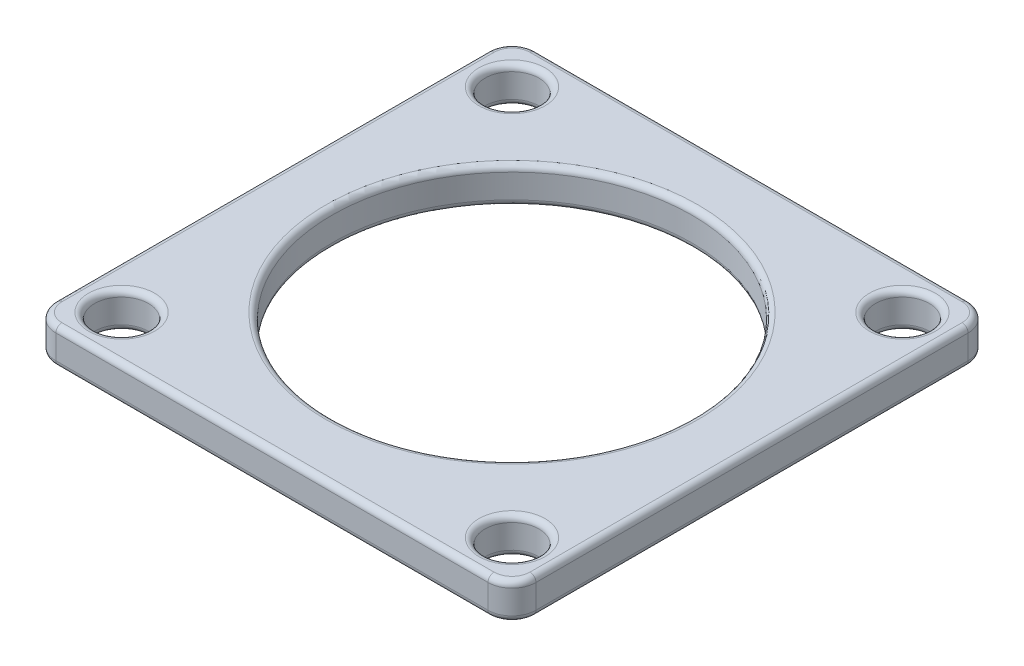
ISO-10303-21;
HEADER;
FILE_DESCRIPTION(('STEP AP214'),'2;1');
FILE_NAME('part.step','',(''),(''),'','','');
FILE_SCHEMA(('AUTOMOTIVE_DESIGN { 1 0 10303 214 1 1 1 1 }'));
ENDSEC;
DATA;
#1=APPLICATION_CONTEXT('core data for automotive mechanical design processes');
#2=APPLICATION_PROTOCOL_DEFINITION('international standard','automotive_design',2000,#1);
#3=PRODUCT_CONTEXT('',#1,'mechanical');
#4=PRODUCT('Part','Part','',(#3));
#5=PRODUCT_RELATED_PRODUCT_CATEGORY('part','',(#4));
#6=PRODUCT_DEFINITION_FORMATION('','',#4);
#7=PRODUCT_DEFINITION_CONTEXT('part definition',#1,'design');
#8=PRODUCT_DEFINITION('design','',#6,#7);
#9=PRODUCT_DEFINITION_SHAPE('','',#8);
#10=(LENGTH_UNIT() NAMED_UNIT(*) SI_UNIT(.MILLI.,.METRE.));
#11=(NAMED_UNIT(*) PLANE_ANGLE_UNIT() SI_UNIT($,.RADIAN.));
#12=(NAMED_UNIT(*) SI_UNIT($,.STERADIAN.) SOLID_ANGLE_UNIT());
#13=UNCERTAINTY_MEASURE_WITH_UNIT(LENGTH_MEASURE(1.E-05),#10,'distance_accuracy_value','');
#14=(GEOMETRIC_REPRESENTATION_CONTEXT(3) GLOBAL_UNCERTAINTY_ASSIGNED_CONTEXT((#13)) GLOBAL_UNIT_ASSIGNED_CONTEXT((#10,
#11,#12)) REPRESENTATION_CONTEXT('',''));
#15=CARTESIAN_POINT('',(0.,0.,0.));
#16=DIRECTION('',(0.,0.,1.));
#17=DIRECTION('',(1.,0.,0.));
#18=AXIS2_PLACEMENT_3D('',#15,#16,#17);
#19=CARTESIAN_POINT('',(18.,3.,18.));
#20=DIRECTION('',(0.,-1.,0.));
#21=DIRECTION('',(0.,0.,-1.));
#22=AXIS2_PLACEMENT_3D('',#19,#20,#21);
#23=PLANE('',#22);
#24=CARTESIAN_POINT('',(0.,3.,0.));
#25=DIRECTION('',(0.,-1.,0.));
#26=DIRECTION('',(0.,0.,-1.));
#27=AXIS2_PLACEMENT_3D('',#24,#25,#26);
#28=CIRCLE('',#27,15.5);
#29=CARTESIAN_POINT('',(0.,3.,-15.5));
#30=VERTEX_POINT('',#29);
#31=EDGE_CURVE('E11',#30,#30,#28,.T.);
#32=ORIENTED_EDGE('',*,*,#31,.T.);
#33=EDGE_LOOP('',(#32));
#34=FACE_BOUND('',#33,.T.);
#35=CARTESIAN_POINT('',(-16.2634559672906,3.,16.2634559672906));
#36=DIRECTION('',(0.,-1.,0.));
#37=DIRECTION('',(0.,0.,-1.));
#38=AXIS2_PLACEMENT_3D('',#35,#36,#37);
#39=CIRCLE('',#38,2.75);
#40=CARTESIAN_POINT('',(-16.2634559672906,3.,13.5134559672906));
#41=VERTEX_POINT('',#40);
#42=EDGE_CURVE('E43',#41,#41,#39,.T.);
#43=ORIENTED_EDGE('',*,*,#42,.T.);
#44=EDGE_LOOP('',(#43));
#45=FACE_BOUND('',#44,.T.);
#46=CARTESIAN_POINT('',(16.2634559672906,3.,16.2634559672906));
#47=DIRECTION('',(0.,-1.,0.));
#48=DIRECTION('',(0.,0.,-1.));
#49=AXIS2_PLACEMENT_3D('',#46,#47,#48);
#50=CIRCLE('',#49,2.75);
#51=CARTESIAN_POINT('',(16.2634559672906,3.,13.5134559672906));
#52=VERTEX_POINT('',#51);
#53=EDGE_CURVE('E273',#52,#52,#50,.T.);
#54=ORIENTED_EDGE('',*,*,#53,.T.);
#55=EDGE_LOOP('',(#54));
#56=FACE_BOUND('',#55,.T.);
#57=CARTESIAN_POINT('',(16.2634559672906,3.,-16.2634559672906));
#58=DIRECTION('',(0.,-1.,0.));
#59=DIRECTION('',(0.,0.,-1.));
#60=AXIS2_PLACEMENT_3D('',#57,#58,#59);
#61=CIRCLE('',#60,2.75);
#62=CARTESIAN_POINT('',(16.2634559672906,3.,-19.0134559672906));
#63=VERTEX_POINT('',#62);
#64=EDGE_CURVE('E270',#63,#63,#61,.T.);
#65=ORIENTED_EDGE('',*,*,#64,.T.);
#66=EDGE_LOOP('',(#65));
#67=FACE_BOUND('',#66,.T.);
#68=CARTESIAN_POINT('',(-16.2634559672906,3.,-16.2634559672906));
#69=DIRECTION('',(0.,-1.,0.));
#70=DIRECTION('',(0.,0.,-1.));
#71=AXIS2_PLACEMENT_3D('',#68,#69,#70);
#72=CIRCLE('',#71,2.75);
#73=CARTESIAN_POINT('',(-16.2634559672906,3.,-19.0134559672906));
#74=VERTEX_POINT('',#73);
#75=EDGE_CURVE('E267',#74,#74,#72,.T.);
#76=ORIENTED_EDGE('',*,*,#75,.T.);
#77=EDGE_LOOP('',(#76));
#78=FACE_BOUND('',#77,.T.);
#79=CARTESIAN_POINT('',(-18.,3.,18.));
#80=DIRECTION('',(0.,-1.,0.));
#81=DIRECTION('',(0.,0.,-1.));
#82=AXIS2_PLACEMENT_3D('',#79,#80,#81);
#83=CIRCLE('',#82,1.5);
#84=CARTESIAN_POINT('',(-19.5,3.,18.));
#85=VERTEX_POINT('',#84);
#86=CARTESIAN_POINT('',(-18.,3.,19.5));
#87=VERTEX_POINT('',#86);
#88=EDGE_CURVE('E51',#85,#87,#83,.F.);
#89=ORIENTED_EDGE('',*,*,#88,.T.);
#90=DIRECTION('',(1.,0.,0.));
#91=VECTOR('',#90,1.);
#92=CARTESIAN_POINT('',(18.,3.,19.5));
#93=LINE('',#92,#91);
#94=CARTESIAN_POINT('',(18.,3.,19.5));
#95=VERTEX_POINT('',#94);
#96=EDGE_CURVE('E265',#87,#95,#93,.T.);
#97=ORIENTED_EDGE('',*,*,#96,.T.);
#98=CARTESIAN_POINT('',(18.,3.,18.));
#99=DIRECTION('',(0.,-1.,0.));
#100=DIRECTION('',(0.,0.,-1.));
#101=AXIS2_PLACEMENT_3D('',#98,#99,#100);
#102=CIRCLE('',#101,1.5);
#103=CARTESIAN_POINT('',(19.5,3.,18.));
#104=VERTEX_POINT('',#103);
#105=EDGE_CURVE('E253',#95,#104,#102,.F.);
#106=ORIENTED_EDGE('',*,*,#105,.T.);
#107=DIRECTION('',(0.,0.,-1.));
#108=VECTOR('',#107,1.);
#109=CARTESIAN_POINT('',(19.5,3.,18.));
#110=LINE('',#109,#108);
#111=CARTESIAN_POINT('',(19.5,3.,-18.));
#112=VERTEX_POINT('',#111);
#113=EDGE_CURVE('E255',#104,#112,#110,.T.);
#114=ORIENTED_EDGE('',*,*,#113,.T.);
#115=CARTESIAN_POINT('',(18.,3.,-18.));
#116=DIRECTION('',(0.,-1.,0.));
#117=DIRECTION('',(0.,0.,-1.));
#118=AXIS2_PLACEMENT_3D('',#115,#116,#117);
#119=CIRCLE('',#118,1.5);
#120=CARTESIAN_POINT('',(18.,3.,-19.5));
#121=VERTEX_POINT('',#120);
#122=EDGE_CURVE('E257',#112,#121,#119,.F.);
#123=ORIENTED_EDGE('',*,*,#122,.T.);
#124=DIRECTION('',(-1.,0.,0.));
#125=VECTOR('',#124,1.);
#126=CARTESIAN_POINT('',(18.,3.,-19.5));
#127=LINE('',#126,#125);
#128=CARTESIAN_POINT('',(-18.,3.,-19.5));
#129=VERTEX_POINT('',#128);
#130=EDGE_CURVE('E259',#121,#129,#127,.T.);
#131=ORIENTED_EDGE('',*,*,#130,.T.);
#132=CARTESIAN_POINT('',(-18.,3.,-18.));
#133=DIRECTION('',(0.,-1.,0.));
#134=DIRECTION('',(0.,0.,-1.));
#135=AXIS2_PLACEMENT_3D('',#132,#133,#134);
#136=CIRCLE('',#135,1.5);
#137=CARTESIAN_POINT('',(-19.5,3.,-18.));
#138=VERTEX_POINT('',#137);
#139=EDGE_CURVE('E261',#129,#138,#136,.F.);
#140=ORIENTED_EDGE('',*,*,#139,.T.);
#141=DIRECTION('',(0.,0.,1.));
#142=VECTOR('',#141,1.);
#143=CARTESIAN_POINT('',(-19.5,3.,18.));
#144=LINE('',#143,#142);
#145=EDGE_CURVE('E56',#138,#85,#144,.T.);
#146=ORIENTED_EDGE('',*,*,#145,.T.);
#147=EDGE_LOOP('',(#89,#97,#106,#114,#123,#131,#140,#146));
#148=FACE_BOUND('',#147,.T.);
#149=ADVANCED_FACE('F34',(#34,#45,#56,#67,#78,#148),#23,.F.);
#150=CARTESIAN_POINT('',(18.,0.,18.));
#151=DIRECTION('',(0.,-1.,0.));
#152=DIRECTION('',(0.,0.,-1.));
#153=AXIS2_PLACEMENT_3D('',#150,#151,#152);
#154=PLANE('',#153);
#155=CARTESIAN_POINT('',(0.,0.,0.));
#156=DIRECTION('',(0.,-1.,0.));
#157=DIRECTION('',(0.,0.,-1.));
#158=AXIS2_PLACEMENT_3D('',#155,#156,#157);
#159=CIRCLE('',#158,15.5);
#160=CARTESIAN_POINT('',(0.,0.,-15.5));
#161=VERTEX_POINT('',#160);
#162=EDGE_CURVE('E188',#161,#161,#159,.F.);
#163=ORIENTED_EDGE('',*,*,#162,.T.);
#164=EDGE_LOOP('',(#163));
#165=FACE_BOUND('',#164,.T.);
#166=CARTESIAN_POINT('',(16.2634559672906,0.,16.2634559672906));
#167=DIRECTION('',(0.,-1.,0.));
#168=DIRECTION('',(0.,0.,-1.));
#169=AXIS2_PLACEMENT_3D('',#166,#167,#168);
#170=CIRCLE('',#169,2.75);
#171=CARTESIAN_POINT('',(16.2634559672906,0.,13.5134559672906));
#172=VERTEX_POINT('',#171);
#173=EDGE_CURVE('E180',#172,#172,#170,.F.);
#174=ORIENTED_EDGE('',*,*,#173,.T.);
#175=EDGE_LOOP('',(#174));
#176=FACE_BOUND('',#175,.T.);
#177=CARTESIAN_POINT('',(-16.2634559672906,0.,-16.2634559672906));
#178=DIRECTION('',(0.,-1.,0.));
#179=DIRECTION('',(0.,0.,-1.));
#180=AXIS2_PLACEMENT_3D('',#177,#178,#179);
#181=CIRCLE('',#180,2.75);
#182=CARTESIAN_POINT('',(-16.2634559672906,0.,-19.0134559672906));
#183=VERTEX_POINT('',#182);
#184=EDGE_CURVE('E177',#183,#183,#181,.F.);
#185=ORIENTED_EDGE('',*,*,#184,.T.);
#186=EDGE_LOOP('',(#185));
#187=FACE_BOUND('',#186,.T.);
#188=CARTESIAN_POINT('',(18.,0.,-18.));
#189=DIRECTION('',(0.,-1.,0.));
#190=DIRECTION('',(0.,0.,-1.));
#191=AXIS2_PLACEMENT_3D('',#188,#189,#190);
#192=CIRCLE('',#191,1.5);
#193=CARTESIAN_POINT('',(18.,0.,-19.5));
#194=VERTEX_POINT('',#193);
#195=CARTESIAN_POINT('',(19.5,0.,-18.));
#196=VERTEX_POINT('',#195);
#197=EDGE_CURVE('E176',#194,#196,#192,.T.);
#198=ORIENTED_EDGE('',*,*,#197,.T.);
#199=DIRECTION('',(0.,0.,-1.));
#200=VECTOR('',#199,1.);
#201=CARTESIAN_POINT('',(19.5,0.,18.));
#202=LINE('',#201,#200);
#203=CARTESIAN_POINT('',(19.5,0.,18.));
#204=VERTEX_POINT('',#203);
#205=EDGE_CURVE('E154',#196,#204,#202,.F.);
#206=ORIENTED_EDGE('',*,*,#205,.T.);
#207=CARTESIAN_POINT('',(18.,0.,18.));
#208=DIRECTION('',(0.,-1.,0.));
#209=DIRECTION('',(0.,0.,-1.));
#210=AXIS2_PLACEMENT_3D('',#207,#208,#209);
#211=CIRCLE('',#210,1.5);
#212=CARTESIAN_POINT('',(18.,0.,19.5));
#213=VERTEX_POINT('',#212);
#214=EDGE_CURVE('E164',#204,#213,#211,.T.);
#215=ORIENTED_EDGE('',*,*,#214,.T.);
#216=DIRECTION('',(1.,0.,0.));
#217=VECTOR('',#216,1.);
#218=CARTESIAN_POINT('',(-18.,0.,19.5));
#219=LINE('',#218,#217);
#220=CARTESIAN_POINT('',(-18.,0.,19.5));
#221=VERTEX_POINT('',#220);
#222=EDGE_CURVE('E170',#213,#221,#219,.F.);
#223=ORIENTED_EDGE('',*,*,#222,.T.);
#224=CARTESIAN_POINT('',(-18.,0.,18.));
#225=DIRECTION('',(0.,-1.,0.));
#226=DIRECTION('',(0.,0.,-1.));
#227=AXIS2_PLACEMENT_3D('',#224,#225,#226);
#228=CIRCLE('',#227,1.5);
#229=CARTESIAN_POINT('',(-19.5,0.,18.));
#230=VERTEX_POINT('',#229);
#231=EDGE_CURVE('E356',#221,#230,#228,.T.);
#232=ORIENTED_EDGE('',*,*,#231,.T.);
#233=DIRECTION('',(0.,0.,1.));
#234=VECTOR('',#233,1.);
#235=CARTESIAN_POINT('',(-19.5,0.,-18.));
#236=LINE('',#235,#234);
#237=CARTESIAN_POINT('',(-19.5,0.,-18.));
#238=VERTEX_POINT('',#237);
#239=EDGE_CURVE('E358',#230,#238,#236,.F.);
#240=ORIENTED_EDGE('',*,*,#239,.T.);
#241=CARTESIAN_POINT('',(-18.,0.,-18.));
#242=DIRECTION('',(0.,-1.,0.));
#243=DIRECTION('',(0.,0.,-1.));
#244=AXIS2_PLACEMENT_3D('',#241,#242,#243);
#245=CIRCLE('',#244,1.5);
#246=CARTESIAN_POINT('',(-18.,0.,-19.5));
#247=VERTEX_POINT('',#246);
#248=EDGE_CURVE('E360',#238,#247,#245,.T.);
#249=ORIENTED_EDGE('',*,*,#248,.T.);
#250=DIRECTION('',(-1.,0.,0.));
#251=VECTOR('',#250,1.);
#252=CARTESIAN_POINT('',(18.,0.,-19.5));
#253=LINE('',#252,#251);
#254=EDGE_CURVE('E182',#247,#194,#253,.F.);
#255=ORIENTED_EDGE('',*,*,#254,.T.);
#256=EDGE_LOOP('',(#198,#206,#215,#223,#232,#240,#249,#255));
#257=FACE_BOUND('',#256,.T.);
#258=CARTESIAN_POINT('',(16.2634559672906,0.,-16.2634559672906));
#259=DIRECTION('',(0.,-1.,0.));
#260=DIRECTION('',(0.,0.,-1.));
#261=AXIS2_PLACEMENT_3D('',#258,#259,#260);
#262=CIRCLE('',#261,2.75);
#263=CARTESIAN_POINT('',(16.2634559672906,0.,-19.0134559672906));
#264=VERTEX_POINT('',#263);
#265=EDGE_CURVE('E171',#264,#264,#262,.F.);
#266=ORIENTED_EDGE('',*,*,#265,.T.);
#267=EDGE_LOOP('',(#266));
#268=FACE_BOUND('',#267,.T.);
#269=CARTESIAN_POINT('',(-16.2634559672906,0.,16.2634559672906));
#270=DIRECTION('',(0.,-1.,0.));
#271=DIRECTION('',(0.,0.,-1.));
#272=AXIS2_PLACEMENT_3D('',#269,#270,#271);
#273=CIRCLE('',#272,2.75);
#274=CARTESIAN_POINT('',(-16.2634559672906,0.,13.5134559672906));
#275=VERTEX_POINT('',#274);
#276=EDGE_CURVE('E350',#275,#275,#273,.F.);
#277=ORIENTED_EDGE('',*,*,#276,.T.);
#278=EDGE_LOOP('',(#277));
#279=FACE_BOUND('',#278,.T.);
#280=ADVANCED_FACE('F173',(#165,#176,#187,#257,#268,#279),#154,.T.);
#281=CARTESIAN_POINT('',(18.,3.,18.));
#282=DIRECTION('',(0.,-1.,0.));
#283=DIRECTION('',(0.,0.,-1.));
#284=AXIS2_PLACEMENT_3D('',#281,#282,#283);
#285=CYLINDRICAL_SURFACE('',#284,2.);
#286=DIRECTION('',(0.,-1.,0.));
#287=VECTOR('',#286,1.);
#288=CARTESIAN_POINT('',(18.,3.,20.));
#289=LINE('',#288,#287);
#290=CARTESIAN_POINT('',(18.,2.5,20.));
#291=VERTEX_POINT('',#290);
#292=CARTESIAN_POINT('',(18.,0.5,20.));
#293=VERTEX_POINT('',#292);
#294=EDGE_CURVE('E294',#291,#293,#289,.T.);
#295=ORIENTED_EDGE('',*,*,#294,.T.);
#296=CARTESIAN_POINT('',(18.,0.5,18.));
#297=DIRECTION('',(0.,-1.,0.));
#298=DIRECTION('',(0.,0.,-1.));
#299=AXIS2_PLACEMENT_3D('',#296,#297,#298);
#300=CIRCLE('',#299,2.);
#301=CARTESIAN_POINT('',(20.,0.5,18.));
#302=VERTEX_POINT('',#301);
#303=EDGE_CURVE('E239',#293,#302,#300,.F.);
#304=ORIENTED_EDGE('',*,*,#303,.T.);
#305=DIRECTION('',(0.,-1.,0.));
#306=VECTOR('',#305,1.);
#307=CARTESIAN_POINT('',(20.,3.,18.));
#308=LINE('',#307,#306);
#309=CARTESIAN_POINT('',(20.,2.5,18.));
#310=VERTEX_POINT('',#309);
#311=EDGE_CURVE('E342',#310,#302,#308,.T.);
#312=ORIENTED_EDGE('',*,*,#311,.F.);
#313=CARTESIAN_POINT('',(18.,2.5,18.));
#314=DIRECTION('',(0.,-1.,0.));
#315=DIRECTION('',(0.,0.,-1.));
#316=AXIS2_PLACEMENT_3D('',#313,#314,#315);
#317=CIRCLE('',#316,2.);
#318=EDGE_CURVE('E237',#310,#291,#317,.T.);
#319=ORIENTED_EDGE('',*,*,#318,.T.);
#320=EDGE_LOOP('',(#295,#304,#312,#319));
#321=FACE_BOUND('',#320,.T.);
#322=ADVANCED_FACE('F377',(#321),#285,.T.);
#323=CARTESIAN_POINT('',(20.,3.,-18.));
#324=DIRECTION('',(-1.,0.,0.));
#325=DIRECTION('',(0.,0.,1.));
#326=AXIS2_PLACEMENT_3D('',#323,#324,#325);
#327=PLANE('',#326);
#328=ORIENTED_EDGE('',*,*,#311,.T.);
#329=DIRECTION('',(0.,0.,-1.));
#330=VECTOR('',#329,1.);
#331=CARTESIAN_POINT('',(20.,0.5,-18.));
#332=LINE('',#331,#330);
#333=CARTESIAN_POINT('',(20.,0.5,-18.));
#334=VERTEX_POINT('',#333);
#335=EDGE_CURVE('E157',#302,#334,#332,.T.);
#336=ORIENTED_EDGE('',*,*,#335,.T.);
#337=DIRECTION('',(0.,-1.,0.));
#338=VECTOR('',#337,1.);
#339=CARTESIAN_POINT('',(20.,3.,-18.));
#340=LINE('',#339,#338);
#341=CARTESIAN_POINT('',(20.,2.5,-18.));
#342=VERTEX_POINT('',#341);
#343=EDGE_CURVE('E340',#342,#334,#340,.T.);
#344=ORIENTED_EDGE('',*,*,#343,.F.);
#345=DIRECTION('',(0.,0.,-1.));
#346=VECTOR('',#345,1.);
#347=CARTESIAN_POINT('',(20.,2.5,-18.));
#348=LINE('',#347,#346);
#349=EDGE_CURVE('E209',#342,#310,#348,.F.);
#350=ORIENTED_EDGE('',*,*,#349,.T.);
#351=EDGE_LOOP('',(#328,#336,#344,#350));
#352=FACE_BOUND('',#351,.T.);
#353=ADVANCED_FACE('F370',(#352),#327,.F.);
#354=CARTESIAN_POINT('',(18.,3.,-18.));
#355=DIRECTION('',(0.,-1.,0.));
#356=DIRECTION('',(0.,0.,-1.));
#357=AXIS2_PLACEMENT_3D('',#354,#355,#356);
#358=CYLINDRICAL_SURFACE('',#357,2.);
#359=ORIENTED_EDGE('',*,*,#343,.T.);
#360=CARTESIAN_POINT('',(18.,0.5,-18.));
#361=DIRECTION('',(0.,-1.,0.));
#362=DIRECTION('',(0.,0.,-1.));
#363=AXIS2_PLACEMENT_3D('',#360,#361,#362);
#364=CIRCLE('',#363,2.);
#365=CARTESIAN_POINT('',(18.,0.5,-20.));
#366=VERTEX_POINT('',#365);
#367=EDGE_CURVE('E214',#334,#366,#364,.F.);
#368=ORIENTED_EDGE('',*,*,#367,.T.);
#369=DIRECTION('',(0.,-1.,0.));
#370=VECTOR('',#369,1.);
#371=CARTESIAN_POINT('',(18.,3.,-20.));
#372=LINE('',#371,#370);
#373=CARTESIAN_POINT('',(18.,2.5,-20.));
#374=VERTEX_POINT('',#373);
#375=EDGE_CURVE('E331',#374,#366,#372,.T.);
#376=ORIENTED_EDGE('',*,*,#375,.F.);
#377=CARTESIAN_POINT('',(18.,2.5,-18.));
#378=DIRECTION('',(0.,-1.,0.));
#379=DIRECTION('',(0.,0.,-1.));
#380=AXIS2_PLACEMENT_3D('',#377,#378,#379);
#381=CIRCLE('',#380,2.);
#382=EDGE_CURVE('E212',#374,#342,#381,.T.);
#383=ORIENTED_EDGE('',*,*,#382,.T.);
#384=EDGE_LOOP('',(#359,#368,#376,#383));
#385=FACE_BOUND('',#384,.T.);
#386=ADVANCED_FACE('F337',(#385),#358,.T.);
#387=CARTESIAN_POINT('',(-18.,3.,-20.));
#388=DIRECTION('',(0.,0.,1.));
#389=DIRECTION('',(1.,0.,0.));
#390=AXIS2_PLACEMENT_3D('',#387,#388,#389);
#391=PLANE('',#390);
#392=ORIENTED_EDGE('',*,*,#375,.T.);
#393=DIRECTION('',(-1.,0.,0.));
#394=VECTOR('',#393,1.);
#395=CARTESIAN_POINT('',(-18.,0.5,-20.));
#396=LINE('',#395,#394);
#397=CARTESIAN_POINT('',(-18.,0.5,-20.));
#398=VERTEX_POINT('',#397);
#399=EDGE_CURVE('E218',#366,#398,#396,.T.);
#400=ORIENTED_EDGE('',*,*,#399,.T.);
#401=DIRECTION('',(0.,-1.,0.));
#402=VECTOR('',#401,1.);
#403=CARTESIAN_POINT('',(-18.,3.,-20.));
#404=LINE('',#403,#402);
#405=CARTESIAN_POINT('',(-18.,2.5,-20.));
#406=VERTEX_POINT('',#405);
#407=EDGE_CURVE('E334',#406,#398,#404,.T.);
#408=ORIENTED_EDGE('',*,*,#407,.F.);
#409=DIRECTION('',(-1.,0.,0.));
#410=VECTOR('',#409,1.);
#411=CARTESIAN_POINT('',(-18.,2.5,-20.));
#412=LINE('',#411,#410);
#413=EDGE_CURVE('E216',#406,#374,#412,.F.);
#414=ORIENTED_EDGE('',*,*,#413,.T.);
#415=EDGE_LOOP('',(#392,#400,#408,#414));
#416=FACE_BOUND('',#415,.T.);
#417=ADVANCED_FACE('F330',(#416),#391,.F.);
#418=CARTESIAN_POINT('',(-18.,3.,-18.));
#419=DIRECTION('',(0.,-1.,0.));
#420=DIRECTION('',(0.,0.,-1.));
#421=AXIS2_PLACEMENT_3D('',#418,#419,#420);
#422=CYLINDRICAL_SURFACE('',#421,2.);
#423=ORIENTED_EDGE('',*,*,#407,.T.);
#424=CARTESIAN_POINT('',(-18.,0.5,-18.));
#425=DIRECTION('',(0.,-1.,0.));
#426=DIRECTION('',(0.,0.,-1.));
#427=AXIS2_PLACEMENT_3D('',#424,#425,#426);
#428=CIRCLE('',#427,2.);
#429=CARTESIAN_POINT('',(-20.,0.5,-18.));
#430=VERTEX_POINT('',#429);
#431=EDGE_CURVE('E222',#398,#430,#428,.F.);
#432=ORIENTED_EDGE('',*,*,#431,.T.);
#433=DIRECTION('',(0.,-1.,0.));
#434=VECTOR('',#433,1.);
#435=CARTESIAN_POINT('',(-20.,3.,-18.));
#436=LINE('',#435,#434);
#437=CARTESIAN_POINT('',(-20.,2.5,-18.));
#438=VERTEX_POINT('',#437);
#439=EDGE_CURVE('E344',#438,#430,#436,.T.);
#440=ORIENTED_EDGE('',*,*,#439,.F.);
#441=CARTESIAN_POINT('',(-18.,2.5,-18.));
#442=DIRECTION('',(0.,-1.,0.));
#443=DIRECTION('',(0.,0.,-1.));
#444=AXIS2_PLACEMENT_3D('',#441,#442,#443);
#445=CIRCLE('',#444,2.);
#446=EDGE_CURVE('E220',#438,#406,#445,.T.);
#447=ORIENTED_EDGE('',*,*,#446,.T.);
#448=EDGE_LOOP('',(#423,#432,#440,#447));
#449=FACE_BOUND('',#448,.T.);
#450=ADVANCED_FACE('F422',(#449),#422,.T.);
#451=CARTESIAN_POINT('',(-20.,3.,-18.));
#452=DIRECTION('',(1.,0.,0.));
#453=DIRECTION('',(0.,0.,-1.));
#454=AXIS2_PLACEMENT_3D('',#451,#452,#453);
#455=PLANE('',#454);
#456=ORIENTED_EDGE('',*,*,#439,.T.);
#457=DIRECTION('',(0.,0.,1.));
#458=VECTOR('',#457,1.);
#459=CARTESIAN_POINT('',(-20.,0.5,18.));
#460=LINE('',#459,#458);
#461=CARTESIAN_POINT('',(-20.,0.5,18.));
#462=VERTEX_POINT('',#461);
#463=EDGE_CURVE('E226',#430,#462,#460,.T.);
#464=ORIENTED_EDGE('',*,*,#463,.T.);
#465=DIRECTION('',(0.,-1.,0.));
#466=VECTOR('',#465,1.);
#467=CARTESIAN_POINT('',(-20.,3.,18.));
#468=LINE('',#467,#466);
#469=CARTESIAN_POINT('',(-20.,2.5,18.));
#470=VERTEX_POINT('',#469);
#471=EDGE_CURVE('E403',#470,#462,#468,.T.);
#472=ORIENTED_EDGE('',*,*,#471,.F.);
#473=DIRECTION('',(0.,0.,1.));
#474=VECTOR('',#473,1.);
#475=CARTESIAN_POINT('',(-20.,2.5,-18.));
#476=LINE('',#475,#474);
#477=EDGE_CURVE('E224',#470,#438,#476,.F.);
#478=ORIENTED_EDGE('',*,*,#477,.T.);
#479=EDGE_LOOP('',(#456,#464,#472,#478));
#480=FACE_BOUND('',#479,.T.);
#481=ADVANCED_FACE('F411',(#480),#455,.F.);
#482=CARTESIAN_POINT('',(-18.,3.,18.));
#483=DIRECTION('',(0.,-1.,0.));
#484=DIRECTION('',(0.,0.,-1.));
#485=AXIS2_PLACEMENT_3D('',#482,#483,#484);
#486=CYLINDRICAL_SURFACE('',#485,2.);
#487=ORIENTED_EDGE('',*,*,#471,.T.);
#488=CARTESIAN_POINT('',(-18.,0.5,18.));
#489=DIRECTION('',(0.,-1.,0.));
#490=DIRECTION('',(0.,0.,-1.));
#491=AXIS2_PLACEMENT_3D('',#488,#489,#490);
#492=CIRCLE('',#491,2.);
#493=CARTESIAN_POINT('',(-18.,0.5,20.));
#494=VERTEX_POINT('',#493);
#495=EDGE_CURVE('E230',#462,#494,#492,.F.);
#496=ORIENTED_EDGE('',*,*,#495,.T.);
#497=DIRECTION('',(0.,-1.,0.));
#498=VECTOR('',#497,1.);
#499=CARTESIAN_POINT('',(-18.,3.,20.));
#500=LINE('',#499,#498);
#501=CARTESIAN_POINT('',(-18.,2.5,20.));
#502=VERTEX_POINT('',#501);
#503=EDGE_CURVE('E396',#502,#494,#500,.T.);
#504=ORIENTED_EDGE('',*,*,#503,.F.);
#505=CARTESIAN_POINT('',(-18.,2.5,18.));
#506=DIRECTION('',(0.,-1.,0.));
#507=DIRECTION('',(0.,0.,-1.));
#508=AXIS2_PLACEMENT_3D('',#505,#506,#507);
#509=CIRCLE('',#508,2.);
#510=EDGE_CURVE('E228',#502,#470,#509,.T.);
#511=ORIENTED_EDGE('',*,*,#510,.T.);
#512=EDGE_LOOP('',(#487,#496,#504,#511));
#513=FACE_BOUND('',#512,.T.);
#514=ADVANCED_FACE('F400',(#513),#486,.T.);
#515=CARTESIAN_POINT('',(-18.,3.,20.));
#516=DIRECTION('',(0.,0.,-1.));
#517=DIRECTION('',(-1.,0.,0.));
#518=AXIS2_PLACEMENT_3D('',#515,#516,#517);
#519=PLANE('',#518);
#520=ORIENTED_EDGE('',*,*,#503,.T.);
#521=DIRECTION('',(1.,0.,0.));
#522=VECTOR('',#521,1.);
#523=CARTESIAN_POINT('',(18.,0.5,20.));
#524=LINE('',#523,#522);
#525=EDGE_CURVE('E235',#494,#293,#524,.T.);
#526=ORIENTED_EDGE('',*,*,#525,.T.);
#527=ORIENTED_EDGE('',*,*,#294,.F.);
#528=DIRECTION('',(1.,0.,0.));
#529=VECTOR('',#528,1.);
#530=CARTESIAN_POINT('',(-18.,2.5,20.));
#531=LINE('',#530,#529);
#532=EDGE_CURVE('E232',#291,#502,#531,.F.);
#533=ORIENTED_EDGE('',*,*,#532,.T.);
#534=EDGE_LOOP('',(#520,#526,#527,#533));
#535=FACE_BOUND('',#534,.T.);
#536=ADVANCED_FACE('F395',(#535),#519,.F.);
#537=CARTESIAN_POINT('',(-16.2634559672906,3.,-16.2634559672906));
#538=DIRECTION('',(0.,-1.,0.));
#539=DIRECTION('',(0.,0.,-1.));
#540=AXIS2_PLACEMENT_3D('',#537,#538,#539);
#541=CYLINDRICAL_SURFACE('',#540,2.25);
#542=CARTESIAN_POINT('',(-16.2634559672906,0.5,-16.2634559672906));
#543=DIRECTION('',(0.,-1.,0.));
#544=DIRECTION('',(0.,0.,-1.));
#545=AXIS2_PLACEMENT_3D('',#542,#543,#544);
#546=CIRCLE('',#545,2.25);
#547=CARTESIAN_POINT('',(-16.2634559672906,0.5,-18.5134559672906));
#548=VERTEX_POINT('',#547);
#549=EDGE_CURVE('E206',#548,#548,#546,.T.);
#550=ORIENTED_EDGE('',*,*,#549,.T.);
#551=EDGE_LOOP('',(#550));
#552=FACE_BOUND('',#551,.T.);
#553=CARTESIAN_POINT('',(-16.2634559672906,2.5,-16.2634559672906));
#554=DIRECTION('',(0.,-1.,0.));
#555=DIRECTION('',(0.,0.,-1.));
#556=AXIS2_PLACEMENT_3D('',#553,#554,#555);
#557=CIRCLE('',#556,2.25);
#558=CARTESIAN_POINT('',(-16.2634559672906,2.5,-18.5134559672906));
#559=VERTEX_POINT('',#558);
#560=EDGE_CURVE('E203',#559,#559,#557,.F.);
#561=ORIENTED_EDGE('',*,*,#560,.T.);
#562=EDGE_LOOP('',(#561));
#563=FACE_BOUND('',#562,.T.);
#564=ADVANCED_FACE('F441',(#552,#563),#541,.F.);
#565=CARTESIAN_POINT('',(16.2634559672906,3.,-16.2634559672906));
#566=DIRECTION('',(0.,-1.,0.));
#567=DIRECTION('',(0.,0.,-1.));
#568=AXIS2_PLACEMENT_3D('',#565,#566,#567);
#569=CYLINDRICAL_SURFACE('',#568,2.25);
#570=CARTESIAN_POINT('',(16.2634559672906,0.5,-16.2634559672906));
#571=DIRECTION('',(0.,-1.,0.));
#572=DIRECTION('',(0.,0.,-1.));
#573=AXIS2_PLACEMENT_3D('',#570,#571,#572);
#574=CIRCLE('',#573,2.25);
#575=CARTESIAN_POINT('',(16.2634559672906,0.5,-18.5134559672906));
#576=VERTEX_POINT('',#575);
#577=EDGE_CURVE('E244',#576,#576,#574,.T.);
#578=ORIENTED_EDGE('',*,*,#577,.T.);
#579=EDGE_LOOP('',(#578));
#580=FACE_BOUND('',#579,.T.);
#581=CARTESIAN_POINT('',(16.2634559672906,2.5,-16.2634559672906));
#582=DIRECTION('',(0.,-1.,0.));
#583=DIRECTION('',(0.,0.,-1.));
#584=AXIS2_PLACEMENT_3D('',#581,#582,#583);
#585=CIRCLE('',#584,2.25);
#586=CARTESIAN_POINT('',(16.2634559672906,2.5,-18.5134559672906));
#587=VERTEX_POINT('',#586);
#588=EDGE_CURVE('E241',#587,#587,#585,.F.);
#589=ORIENTED_EDGE('',*,*,#588,.T.);
#590=EDGE_LOOP('',(#589));
#591=FACE_BOUND('',#590,.T.);
#592=ADVANCED_FACE('F461',(#580,#591),#569,.F.);
#593=CARTESIAN_POINT('',(16.2634559672906,3.,16.2634559672906));
#594=DIRECTION('',(0.,-1.,0.));
#595=DIRECTION('',(0.,0.,-1.));
#596=AXIS2_PLACEMENT_3D('',#593,#594,#595);
#597=CYLINDRICAL_SURFACE('',#596,2.25);
#598=CARTESIAN_POINT('',(16.2634559672906,0.5,16.2634559672906));
#599=DIRECTION('',(0.,-1.,0.));
#600=DIRECTION('',(0.,0.,-1.));
#601=AXIS2_PLACEMENT_3D('',#598,#599,#600);
#602=CIRCLE('',#601,2.25);
#603=CARTESIAN_POINT('',(16.2634559672906,0.5,14.0134559672906));
#604=VERTEX_POINT('',#603);
#605=EDGE_CURVE('E200',#604,#604,#602,.T.);
#606=ORIENTED_EDGE('',*,*,#605,.T.);
#607=EDGE_LOOP('',(#606));
#608=FACE_BOUND('',#607,.T.);
#609=CARTESIAN_POINT('',(16.2634559672906,2.5,16.2634559672906));
#610=DIRECTION('',(0.,-1.,0.));
#611=DIRECTION('',(0.,0.,-1.));
#612=AXIS2_PLACEMENT_3D('',#609,#610,#611);
#613=CIRCLE('',#612,2.25);
#614=CARTESIAN_POINT('',(16.2634559672906,2.5,14.0134559672906));
#615=VERTEX_POINT('',#614);
#616=EDGE_CURVE('E197',#615,#615,#613,.F.);
#617=ORIENTED_EDGE('',*,*,#616,.T.);
#618=EDGE_LOOP('',(#617));
#619=FACE_BOUND('',#618,.T.);
#620=ADVANCED_FACE('F468',(#608,#619),#597,.F.);
#621=CARTESIAN_POINT('',(-16.2634559672906,3.,16.2634559672906));
#622=DIRECTION('',(0.,-1.,0.));
#623=DIRECTION('',(0.,0.,-1.));
#624=AXIS2_PLACEMENT_3D('',#621,#622,#623);
#625=CYLINDRICAL_SURFACE('',#624,2.25);
#626=CARTESIAN_POINT('',(-16.2634559672906,0.5,16.2634559672906));
#627=DIRECTION('',(0.,-1.,0.));
#628=DIRECTION('',(0.,0.,-1.));
#629=AXIS2_PLACEMENT_3D('',#626,#627,#628);
#630=CIRCLE('',#629,2.25);
#631=CARTESIAN_POINT('',(-16.2634559672906,0.5,14.0134559672906));
#632=VERTEX_POINT('',#631);
#633=EDGE_CURVE('E250',#632,#632,#630,.T.);
#634=ORIENTED_EDGE('',*,*,#633,.T.);
#635=EDGE_LOOP('',(#634));
#636=FACE_BOUND('',#635,.T.);
#637=CARTESIAN_POINT('',(-16.2634559672906,2.5,16.2634559672906));
#638=DIRECTION('',(0.,-1.,0.));
#639=DIRECTION('',(0.,0.,-1.));
#640=AXIS2_PLACEMENT_3D('',#637,#638,#639);
#641=CIRCLE('',#640,2.25);
#642=CARTESIAN_POINT('',(-16.2634559672906,2.5,14.0134559672906));
#643=VERTEX_POINT('',#642);
#644=EDGE_CURVE('E247',#643,#643,#641,.F.);
#645=ORIENTED_EDGE('',*,*,#644,.T.);
#646=EDGE_LOOP('',(#645));
#647=FACE_BOUND('',#646,.T.);
#648=ADVANCED_FACE('F475',(#636,#647),#625,.F.);
#649=CARTESIAN_POINT('',(0.,3.,0.));
#650=DIRECTION('',(0.,-1.,0.));
#651=DIRECTION('',(0.,0.,-1.));
#652=AXIS2_PLACEMENT_3D('',#649,#650,#651);
#653=CYLINDRICAL_SURFACE('',#652,15.);
#654=CARTESIAN_POINT('',(0.,0.5,0.));
#655=DIRECTION('',(0.,-1.,0.));
#656=DIRECTION('',(0.,0.,-1.));
#657=AXIS2_PLACEMENT_3D('',#654,#655,#656);
#658=CIRCLE('',#657,15.);
#659=CARTESIAN_POINT('',(0.,0.5,-15.));
#660=VERTEX_POINT('',#659);
#661=EDGE_CURVE('E194',#660,#660,#658,.T.);
#662=ORIENTED_EDGE('',*,*,#661,.T.);
#663=EDGE_LOOP('',(#662));
#664=FACE_BOUND('',#663,.T.);
#665=CARTESIAN_POINT('',(0.,2.5,0.));
#666=DIRECTION('',(0.,-1.,0.));
#667=DIRECTION('',(0.,0.,-1.));
#668=AXIS2_PLACEMENT_3D('',#665,#666,#667);
#669=CIRCLE('',#668,15.);
#670=CARTESIAN_POINT('',(0.,2.5,-15.));
#671=VERTEX_POINT('',#670);
#672=EDGE_CURVE('E191',#671,#671,#669,.F.);
#673=ORIENTED_EDGE('',*,*,#672,.T.);
#674=EDGE_LOOP('',(#673));
#675=FACE_BOUND('',#674,.T.);
#676=ADVANCED_FACE('F483',(#664,#675),#653,.F.);
#677=CARTESIAN_POINT('',(0.,0.5,0.));
#678=DIRECTION('',(0.,-1.,0.));
#679=DIRECTION('',(0.,0.,-1.));
#680=AXIS2_PLACEMENT_3D('',#677,#678,#679);
#681=TOROIDAL_SURFACE('',#680,15.5,0.5);
#682=ORIENTED_EDGE('',*,*,#661,.F.);
#683=EDGE_LOOP('',(#682));
#684=FACE_BOUND('',#683,.T.);
#685=ORIENTED_EDGE('',*,*,#162,.F.);
#686=EDGE_LOOP('',(#685));
#687=FACE_BOUND('',#686,.T.);
#688=ADVANCED_FACE('F491',(#684,#687),#681,.T.);
#689=CARTESIAN_POINT('',(16.2634559672906,0.5,16.2634559672906));
#690=DIRECTION('',(0.,-1.,0.));
#691=DIRECTION('',(0.,0.,-1.));
#692=AXIS2_PLACEMENT_3D('',#689,#690,#691);
#693=TOROIDAL_SURFACE('',#692,2.75,0.5);
#694=ORIENTED_EDGE('',*,*,#605,.F.);
#695=EDGE_LOOP('',(#694));
#696=FACE_BOUND('',#695,.T.);
#697=ORIENTED_EDGE('',*,*,#173,.F.);
#698=EDGE_LOOP('',(#697));
#699=FACE_BOUND('',#698,.T.);
#700=ADVANCED_FACE('F499',(#696,#699),#693,.T.);
#701=CARTESIAN_POINT('',(-16.2634559672906,0.5,-16.2634559672906));
#702=DIRECTION('',(0.,-1.,0.));
#703=DIRECTION('',(0.,0.,-1.));
#704=AXIS2_PLACEMENT_3D('',#701,#702,#703);
#705=TOROIDAL_SURFACE('',#704,2.75,0.5);
#706=ORIENTED_EDGE('',*,*,#549,.F.);
#707=EDGE_LOOP('',(#706));
#708=FACE_BOUND('',#707,.T.);
#709=ORIENTED_EDGE('',*,*,#184,.F.);
#710=EDGE_LOOP('',(#709));
#711=FACE_BOUND('',#710,.T.);
#712=ADVANCED_FACE('F507',(#708,#711),#705,.T.);
#713=CARTESIAN_POINT('',(-19.5,0.5,-18.));
#714=DIRECTION('',(0.,0.,-1.));
#715=DIRECTION('',(-1.,0.,0.));
#716=AXIS2_PLACEMENT_3D('',#713,#714,#715);
#717=CYLINDRICAL_SURFACE('',#716,0.5);
#718=CARTESIAN_POINT('',(-19.5,0.5,-18.));
#719=DIRECTION('',(0.,0.,-1.));
#720=DIRECTION('',(-1.,0.,0.));
#721=AXIS2_PLACEMENT_3D('',#718,#719,#720);
#722=CIRCLE('',#721,0.5);
#723=EDGE_CURVE('E288',#238,#430,#722,.T.);
#724=ORIENTED_EDGE('',*,*,#723,.F.);
#725=ORIENTED_EDGE('',*,*,#239,.F.);
#726=CARTESIAN_POINT('',(-19.5,0.5,18.));
#727=DIRECTION('',(0.,0.,1.));
#728=DIRECTION('',(1.,0.,0.));
#729=AXIS2_PLACEMENT_3D('',#726,#727,#728);
#730=CIRCLE('',#729,0.5);
#731=EDGE_CURVE('E291',#462,#230,#730,.T.);
#732=ORIENTED_EDGE('',*,*,#731,.F.);
#733=ORIENTED_EDGE('',*,*,#463,.F.);
#734=EDGE_LOOP('',(#724,#725,#732,#733));
#735=FACE_BOUND('',#734,.T.);
#736=ADVANCED_FACE('F417',(#735),#717,.T.);
#737=CARTESIAN_POINT('',(-18.,0.5,18.));
#738=DIRECTION('',(0.,-1.,0.));
#739=DIRECTION('',(0.,0.,-1.));
#740=AXIS2_PLACEMENT_3D('',#737,#738,#739);
#741=TOROIDAL_SURFACE('',#740,1.5,0.5);
#742=ORIENTED_EDGE('',*,*,#731,.T.);
#743=ORIENTED_EDGE('',*,*,#231,.F.);
#744=CARTESIAN_POINT('',(-18.,0.5,19.5));
#745=DIRECTION('',(1.,0.,0.));
#746=DIRECTION('',(0.,0.,-1.));
#747=AXIS2_PLACEMENT_3D('',#744,#745,#746);
#748=CIRCLE('',#747,0.5);
#749=EDGE_CURVE('E285',#494,#221,#748,.T.);
#750=ORIENTED_EDGE('',*,*,#749,.F.);
#751=ORIENTED_EDGE('',*,*,#495,.F.);
#752=EDGE_LOOP('',(#742,#743,#750,#751));
#753=FACE_BOUND('',#752,.T.);
#754=ADVANCED_FACE('F522',(#753),#741,.T.);
#755=CARTESIAN_POINT('',(-18.,0.5,-18.));
#756=DIRECTION('',(0.,-1.,0.));
#757=DIRECTION('',(0.,0.,-1.));
#758=AXIS2_PLACEMENT_3D('',#755,#756,#757);
#759=TOROIDAL_SURFACE('',#758,1.5,0.5);
#760=ORIENTED_EDGE('',*,*,#723,.T.);
#761=ORIENTED_EDGE('',*,*,#431,.F.);
#762=CARTESIAN_POINT('',(-18.,0.5,-19.5));
#763=DIRECTION('',(1.,0.,0.));
#764=DIRECTION('',(0.,0.,-1.));
#765=AXIS2_PLACEMENT_3D('',#762,#763,#764);
#766=CIRCLE('',#765,0.5);
#767=EDGE_CURVE('E282',#247,#398,#766,.T.);
#768=ORIENTED_EDGE('',*,*,#767,.F.);
#769=ORIENTED_EDGE('',*,*,#248,.F.);
#770=EDGE_LOOP('',(#760,#761,#768,#769));
#771=FACE_BOUND('',#770,.T.);
#772=ADVANCED_FACE('F421',(#771),#759,.T.);
#773=CARTESIAN_POINT('',(-18.,0.5,19.5));
#774=DIRECTION('',(-1.,0.,0.));
#775=DIRECTION('',(0.,0.,1.));
#776=AXIS2_PLACEMENT_3D('',#773,#774,#775);
#777=CYLINDRICAL_SURFACE('',#776,0.5);
#778=ORIENTED_EDGE('',*,*,#749,.T.);
#779=ORIENTED_EDGE('',*,*,#222,.F.);
#780=CARTESIAN_POINT('',(18.,0.5,19.5));
#781=DIRECTION('',(1.,0.,0.));
#782=DIRECTION('',(0.,0.,-1.));
#783=AXIS2_PLACEMENT_3D('',#780,#781,#782);
#784=CIRCLE('',#783,0.5);
#785=EDGE_CURVE('E167',#293,#213,#784,.T.);
#786=ORIENTED_EDGE('',*,*,#785,.F.);
#787=ORIENTED_EDGE('',*,*,#525,.F.);
#788=EDGE_LOOP('',(#778,#779,#786,#787));
#789=FACE_BOUND('',#788,.T.);
#790=ADVANCED_FACE('F536',(#789),#777,.T.);
#791=CARTESIAN_POINT('',(-18.,0.5,-19.5));
#792=DIRECTION('',(1.,0.,0.));
#793=DIRECTION('',(0.,0.,-1.));
#794=AXIS2_PLACEMENT_3D('',#791,#792,#793);
#795=CYLINDRICAL_SURFACE('',#794,0.5);
#796=ORIENTED_EDGE('',*,*,#767,.T.);
#797=ORIENTED_EDGE('',*,*,#399,.F.);
#798=CARTESIAN_POINT('',(18.,0.5,-19.5));
#799=DIRECTION('',(1.,0.,0.));
#800=DIRECTION('',(0.,0.,-1.));
#801=AXIS2_PLACEMENT_3D('',#798,#799,#800);
#802=CIRCLE('',#801,0.5);
#803=EDGE_CURVE('E160',#194,#366,#802,.T.);
#804=ORIENTED_EDGE('',*,*,#803,.F.);
#805=ORIENTED_EDGE('',*,*,#254,.F.);
#806=EDGE_LOOP('',(#796,#797,#804,#805));
#807=FACE_BOUND('',#806,.T.);
#808=ADVANCED_FACE('F366',(#807),#795,.T.);
#809=CARTESIAN_POINT('',(18.,0.5,18.));
#810=DIRECTION('',(0.,-1.,0.));
#811=DIRECTION('',(0.,0.,-1.));
#812=AXIS2_PLACEMENT_3D('',#809,#810,#811);
#813=TOROIDAL_SURFACE('',#812,1.5,0.5);
#814=ORIENTED_EDGE('',*,*,#785,.T.);
#815=ORIENTED_EDGE('',*,*,#214,.F.);
#816=CARTESIAN_POINT('',(19.5,0.5,18.));
#817=DIRECTION('',(0.,0.,-1.));
#818=DIRECTION('',(-1.,0.,0.));
#819=AXIS2_PLACEMENT_3D('',#816,#817,#818);
#820=CIRCLE('',#819,0.5);
#821=EDGE_CURVE('E150',#302,#204,#820,.T.);
#822=ORIENTED_EDGE('',*,*,#821,.F.);
#823=ORIENTED_EDGE('',*,*,#303,.F.);
#824=EDGE_LOOP('',(#814,#815,#822,#823));
#825=FACE_BOUND('',#824,.T.);
#826=ADVANCED_FACE('F165',(#825),#813,.T.);
#827=CARTESIAN_POINT('',(18.,0.5,-18.));
#828=DIRECTION('',(0.,-1.,0.));
#829=DIRECTION('',(0.,0.,-1.));
#830=AXIS2_PLACEMENT_3D('',#827,#828,#829);
#831=TOROIDAL_SURFACE('',#830,1.5,0.5);
#832=ORIENTED_EDGE('',*,*,#803,.T.);
#833=ORIENTED_EDGE('',*,*,#367,.F.);
#834=CARTESIAN_POINT('',(19.5,0.5,-18.));
#835=DIRECTION('',(0.,0.,1.));
#836=DIRECTION('',(1.,0.,0.));
#837=AXIS2_PLACEMENT_3D('',#834,#835,#836);
#838=CIRCLE('',#837,0.5);
#839=EDGE_CURVE('E161',#196,#334,#838,.T.);
#840=ORIENTED_EDGE('',*,*,#839,.F.);
#841=ORIENTED_EDGE('',*,*,#197,.F.);
#842=EDGE_LOOP('',(#832,#833,#840,#841));
#843=FACE_BOUND('',#842,.T.);
#844=ADVANCED_FACE('F368',(#843),#831,.T.);
#845=CARTESIAN_POINT('',(19.5,0.5,-18.));
#846=DIRECTION('',(0.,0.,1.));
#847=DIRECTION('',(1.,0.,0.));
#848=AXIS2_PLACEMENT_3D('',#845,#846,#847);
#849=CYLINDRICAL_SURFACE('',#848,0.5);
#850=ORIENTED_EDGE('',*,*,#821,.T.);
#851=ORIENTED_EDGE('',*,*,#205,.F.);
#852=ORIENTED_EDGE('',*,*,#839,.T.);
#853=ORIENTED_EDGE('',*,*,#335,.F.);
#854=EDGE_LOOP('',(#850,#851,#852,#853));
#855=FACE_BOUND('',#854,.T.);
#856=ADVANCED_FACE('F152',(#855),#849,.T.);
#857=CARTESIAN_POINT('',(16.2634559672906,0.5,-16.2634559672906));
#858=DIRECTION('',(0.,-1.,0.));
#859=DIRECTION('',(0.,0.,-1.));
#860=AXIS2_PLACEMENT_3D('',#857,#858,#859);
#861=TOROIDAL_SURFACE('',#860,2.75,0.5);
#862=ORIENTED_EDGE('',*,*,#577,.F.);
#863=EDGE_LOOP('',(#862));
#864=FACE_BOUND('',#863,.T.);
#865=ORIENTED_EDGE('',*,*,#265,.F.);
#866=EDGE_LOOP('',(#865));
#867=FACE_BOUND('',#866,.T.);
#868=ADVANCED_FACE('F568',(#864,#867),#861,.T.);
#869=CARTESIAN_POINT('',(-16.2634559672906,0.5,16.2634559672906));
#870=DIRECTION('',(0.,-1.,0.));
#871=DIRECTION('',(0.,0.,-1.));
#872=AXIS2_PLACEMENT_3D('',#869,#870,#871);
#873=TOROIDAL_SURFACE('',#872,2.75,0.5);
#874=ORIENTED_EDGE('',*,*,#633,.F.);
#875=EDGE_LOOP('',(#874));
#876=FACE_BOUND('',#875,.T.);
#877=ORIENTED_EDGE('',*,*,#276,.F.);
#878=EDGE_LOOP('',(#877));
#879=FACE_BOUND('',#878,.T.);
#880=ADVANCED_FACE('F575',(#876,#879),#873,.T.);
#881=CARTESIAN_POINT('',(0.,2.5,0.));
#882=DIRECTION('',(0.,-1.,0.));
#883=DIRECTION('',(0.,0.,-1.));
#884=AXIS2_PLACEMENT_3D('',#881,#882,#883);
#885=TOROIDAL_SURFACE('',#884,15.5,0.5);
#886=ORIENTED_EDGE('',*,*,#31,.F.);
#887=EDGE_LOOP('',(#886));
#888=FACE_BOUND('',#887,.T.);
#889=ORIENTED_EDGE('',*,*,#672,.F.);
#890=EDGE_LOOP('',(#889));
#891=FACE_BOUND('',#890,.T.);
#892=ADVANCED_FACE('F583',(#888,#891),#885,.T.);
#893=CARTESIAN_POINT('',(-16.2634559672906,2.5,16.2634559672906));
#894=DIRECTION('',(0.,-1.,0.));
#895=DIRECTION('',(0.,0.,-1.));
#896=AXIS2_PLACEMENT_3D('',#893,#894,#895);
#897=TOROIDAL_SURFACE('',#896,2.75,0.5);
#898=ORIENTED_EDGE('',*,*,#42,.F.);
#899=EDGE_LOOP('',(#898));
#900=FACE_BOUND('',#899,.T.);
#901=ORIENTED_EDGE('',*,*,#644,.F.);
#902=EDGE_LOOP('',(#901));
#903=FACE_BOUND('',#902,.T.);
#904=ADVANCED_FACE('F591',(#900,#903),#897,.T.);
#905=CARTESIAN_POINT('',(16.2634559672906,2.5,16.2634559672906));
#906=DIRECTION('',(0.,-1.,0.));
#907=DIRECTION('',(0.,0.,-1.));
#908=AXIS2_PLACEMENT_3D('',#905,#906,#907);
#909=TOROIDAL_SURFACE('',#908,2.75,0.5);
#910=ORIENTED_EDGE('',*,*,#53,.F.);
#911=EDGE_LOOP('',(#910));
#912=FACE_BOUND('',#911,.T.);
#913=ORIENTED_EDGE('',*,*,#616,.F.);
#914=EDGE_LOOP('',(#913));
#915=FACE_BOUND('',#914,.T.);
#916=ADVANCED_FACE('F599',(#912,#915),#909,.T.);
#917=CARTESIAN_POINT('',(16.2634559672906,2.5,-16.2634559672906));
#918=DIRECTION('',(0.,-1.,0.));
#919=DIRECTION('',(0.,0.,-1.));
#920=AXIS2_PLACEMENT_3D('',#917,#918,#919);
#921=TOROIDAL_SURFACE('',#920,2.75,0.5);
#922=ORIENTED_EDGE('',*,*,#64,.F.);
#923=EDGE_LOOP('',(#922));
#924=FACE_BOUND('',#923,.T.);
#925=ORIENTED_EDGE('',*,*,#588,.F.);
#926=EDGE_LOOP('',(#925));
#927=FACE_BOUND('',#926,.T.);
#928=ADVANCED_FACE('F607',(#924,#927),#921,.T.);
#929=CARTESIAN_POINT('',(-16.2634559672906,2.5,-16.2634559672906));
#930=DIRECTION('',(0.,-1.,0.));
#931=DIRECTION('',(0.,0.,-1.));
#932=AXIS2_PLACEMENT_3D('',#929,#930,#931);
#933=TOROIDAL_SURFACE('',#932,2.75,0.5);
#934=ORIENTED_EDGE('',*,*,#75,.F.);
#935=EDGE_LOOP('',(#934));
#936=FACE_BOUND('',#935,.T.);
#937=ORIENTED_EDGE('',*,*,#560,.F.);
#938=EDGE_LOOP('',(#937));
#939=FACE_BOUND('',#938,.T.);
#940=ADVANCED_FACE('F615',(#936,#939),#933,.T.);
#941=CARTESIAN_POINT('',(18.,2.5,-19.5));
#942=DIRECTION('',(-1.,0.,0.));
#943=DIRECTION('',(0.,0.,1.));
#944=AXIS2_PLACEMENT_3D('',#941,#942,#943);
#945=CYLINDRICAL_SURFACE('',#944,0.5);
#946=CARTESIAN_POINT('',(18.,2.5,-19.5));
#947=DIRECTION('',(1.,0.,0.));
#948=DIRECTION('',(0.,0.,-1.));
#949=AXIS2_PLACEMENT_3D('',#946,#947,#948);
#950=CIRCLE('',#949,0.5);
#951=EDGE_CURVE('E310',#374,#121,#950,.T.);
#952=ORIENTED_EDGE('',*,*,#951,.F.);
#953=ORIENTED_EDGE('',*,*,#413,.F.);
#954=CARTESIAN_POINT('',(-18.,2.5,-19.5));
#955=DIRECTION('',(-1.,0.,0.));
#956=DIRECTION('',(0.,0.,1.));
#957=AXIS2_PLACEMENT_3D('',#954,#955,#956);
#958=CIRCLE('',#957,0.5);
#959=EDGE_CURVE('E38',#129,#406,#958,.T.);
#960=ORIENTED_EDGE('',*,*,#959,.F.);
#961=ORIENTED_EDGE('',*,*,#130,.F.);
#962=EDGE_LOOP('',(#952,#953,#960,#961));
#963=FACE_BOUND('',#962,.T.);
#964=ADVANCED_FACE('F36',(#963),#945,.T.);
#965=CARTESIAN_POINT('',(-18.,2.5,-18.));
#966=DIRECTION('',(0.,-1.,0.));
#967=DIRECTION('',(0.,0.,-1.));
#968=AXIS2_PLACEMENT_3D('',#965,#966,#967);
#969=TOROIDAL_SURFACE('',#968,1.5,0.5);
#970=ORIENTED_EDGE('',*,*,#959,.T.);
#971=ORIENTED_EDGE('',*,*,#446,.F.);
#972=CARTESIAN_POINT('',(-19.5,2.5,-18.));
#973=DIRECTION('',(0.,0.,1.));
#974=DIRECTION('',(1.,0.,0.));
#975=AXIS2_PLACEMENT_3D('',#972,#973,#974);
#976=CIRCLE('',#975,0.5);
#977=EDGE_CURVE('E308',#138,#438,#976,.T.);
#978=ORIENTED_EDGE('',*,*,#977,.F.);
#979=ORIENTED_EDGE('',*,*,#139,.F.);
#980=EDGE_LOOP('',(#970,#971,#978,#979));
#981=FACE_BOUND('',#980,.T.);
#982=ADVANCED_FACE('F321',(#981),#969,.T.);
#983=CARTESIAN_POINT('',(18.,2.5,-18.));
#984=DIRECTION('',(0.,-1.,0.));
#985=DIRECTION('',(0.,0.,-1.));
#986=AXIS2_PLACEMENT_3D('',#983,#984,#985);
#987=TOROIDAL_SURFACE('',#986,1.5,0.5);
#988=ORIENTED_EDGE('',*,*,#951,.T.);
#989=ORIENTED_EDGE('',*,*,#122,.F.);
#990=CARTESIAN_POINT('',(19.5,2.5,-18.));
#991=DIRECTION('',(0.,0.,1.));
#992=DIRECTION('',(1.,0.,0.));
#993=AXIS2_PLACEMENT_3D('',#990,#991,#992);
#994=CIRCLE('',#993,0.5);
#995=EDGE_CURVE('E305',#342,#112,#994,.T.);
#996=ORIENTED_EDGE('',*,*,#995,.F.);
#997=ORIENTED_EDGE('',*,*,#382,.F.);
#998=EDGE_LOOP('',(#988,#989,#996,#997));
#999=FACE_BOUND('',#998,.T.);
#1000=ADVANCED_FACE('F635',(#999),#987,.T.);
#1001=CARTESIAN_POINT('',(-19.5,2.5,18.));
#1002=DIRECTION('',(0.,0.,1.));
#1003=DIRECTION('',(1.,0.,0.));
#1004=AXIS2_PLACEMENT_3D('',#1001,#1002,#1003);
#1005=CYLINDRICAL_SURFACE('',#1004,0.5);
#1006=ORIENTED_EDGE('',*,*,#977,.T.);
#1007=ORIENTED_EDGE('',*,*,#477,.F.);
#1008=CARTESIAN_POINT('',(-19.5,2.5,18.));
#1009=DIRECTION('',(0.,0.,1.));
#1010=DIRECTION('',(1.,0.,0.));
#1011=AXIS2_PLACEMENT_3D('',#1008,#1009,#1010);
#1012=CIRCLE('',#1011,0.5);
#1013=EDGE_CURVE('E302',#85,#470,#1012,.T.);
#1014=ORIENTED_EDGE('',*,*,#1013,.F.);
#1015=ORIENTED_EDGE('',*,*,#145,.F.);
#1016=EDGE_LOOP('',(#1006,#1007,#1014,#1015));
#1017=FACE_BOUND('',#1016,.T.);
#1018=ADVANCED_FACE('F641',(#1017),#1005,.T.);
#1019=CARTESIAN_POINT('',(19.5,2.5,18.));
#1020=DIRECTION('',(0.,0.,-1.));
#1021=DIRECTION('',(-1.,0.,0.));
#1022=AXIS2_PLACEMENT_3D('',#1019,#1020,#1021);
#1023=CYLINDRICAL_SURFACE('',#1022,0.5);
#1024=ORIENTED_EDGE('',*,*,#995,.T.);
#1025=ORIENTED_EDGE('',*,*,#113,.F.);
#1026=CARTESIAN_POINT('',(19.5,2.5,18.));
#1027=DIRECTION('',(0.,0.,1.));
#1028=DIRECTION('',(1.,0.,0.));
#1029=AXIS2_PLACEMENT_3D('',#1026,#1027,#1028);
#1030=CIRCLE('',#1029,0.5);
#1031=EDGE_CURVE('E299',#310,#104,#1030,.T.);
#1032=ORIENTED_EDGE('',*,*,#1031,.F.);
#1033=ORIENTED_EDGE('',*,*,#349,.F.);
#1034=EDGE_LOOP('',(#1024,#1025,#1032,#1033));
#1035=FACE_BOUND('',#1034,.T.);
#1036=ADVANCED_FACE('F382',(#1035),#1023,.T.);
#1037=CARTESIAN_POINT('',(-18.,2.5,18.));
#1038=DIRECTION('',(0.,-1.,0.));
#1039=DIRECTION('',(0.,0.,-1.));
#1040=AXIS2_PLACEMENT_3D('',#1037,#1038,#1039);
#1041=TOROIDAL_SURFACE('',#1040,1.5,0.5);
#1042=ORIENTED_EDGE('',*,*,#1013,.T.);
#1043=ORIENTED_EDGE('',*,*,#510,.F.);
#1044=CARTESIAN_POINT('',(-18.,2.5,19.5));
#1045=DIRECTION('',(1.,0.,0.));
#1046=DIRECTION('',(0.,0.,-1.));
#1047=AXIS2_PLACEMENT_3D('',#1044,#1045,#1046);
#1048=CIRCLE('',#1047,0.5);
#1049=EDGE_CURVE('E297',#87,#502,#1048,.T.);
#1050=ORIENTED_EDGE('',*,*,#1049,.F.);
#1051=ORIENTED_EDGE('',*,*,#88,.F.);
#1052=EDGE_LOOP('',(#1042,#1043,#1050,#1051));
#1053=FACE_BOUND('',#1052,.T.);
#1054=ADVANCED_FACE('F655',(#1053),#1041,.T.);
#1055=CARTESIAN_POINT('',(18.,2.5,18.));
#1056=DIRECTION('',(0.,-1.,0.));
#1057=DIRECTION('',(0.,0.,-1.));
#1058=AXIS2_PLACEMENT_3D('',#1055,#1056,#1057);
#1059=TOROIDAL_SURFACE('',#1058,1.5,0.5);
#1060=ORIENTED_EDGE('',*,*,#1031,.T.);
#1061=ORIENTED_EDGE('',*,*,#105,.F.);
#1062=CARTESIAN_POINT('',(18.,2.5,19.5));
#1063=DIRECTION('',(-1.,0.,0.));
#1064=DIRECTION('',(0.,0.,1.));
#1065=AXIS2_PLACEMENT_3D('',#1062,#1063,#1064);
#1066=CIRCLE('',#1065,0.5);
#1067=EDGE_CURVE('E295',#291,#95,#1066,.T.);
#1068=ORIENTED_EDGE('',*,*,#1067,.F.);
#1069=ORIENTED_EDGE('',*,*,#318,.F.);
#1070=EDGE_LOOP('',(#1060,#1061,#1068,#1069));
#1071=FACE_BOUND('',#1070,.T.);
#1072=ADVANCED_FACE('F386',(#1071),#1059,.T.);
#1073=CARTESIAN_POINT('',(18.,2.5,19.5));
#1074=DIRECTION('',(1.,0.,0.));
#1075=DIRECTION('',(0.,0.,-1.));
#1076=AXIS2_PLACEMENT_3D('',#1073,#1074,#1075);
#1077=CYLINDRICAL_SURFACE('',#1076,0.5);
#1078=ORIENTED_EDGE('',*,*,#1049,.T.);
#1079=ORIENTED_EDGE('',*,*,#532,.F.);
#1080=ORIENTED_EDGE('',*,*,#1067,.T.);
#1081=ORIENTED_EDGE('',*,*,#96,.F.);
#1082=EDGE_LOOP('',(#1078,#1079,#1080,#1081));
#1083=FACE_BOUND('',#1082,.T.);
#1084=ADVANCED_FACE('F390',(#1083),#1077,.T.);
#1085=CLOSED_SHELL('',(#149,#280,#322,#353,#386,#417,#450,#481,#514,#536,#564,#592,#620,#648,
#676,#688,#700,#712,#736,#754,#772,#790,#808,#826,#844,#856,#868,#880,#892,#904,#916,#928,#940,
#964,#982,#1000,#1018,#1036,#1054,#1072,#1084));
#1086=MANIFOLD_SOLID_BREP('B2',#1085);
#1087=ADVANCED_BREP_SHAPE_REPRESENTATION('',(#18,#1086),#14);
#1088=SHAPE_DEFINITION_REPRESENTATION(#9,#1087);
ENDSEC;
END-ISO-10303-21;
